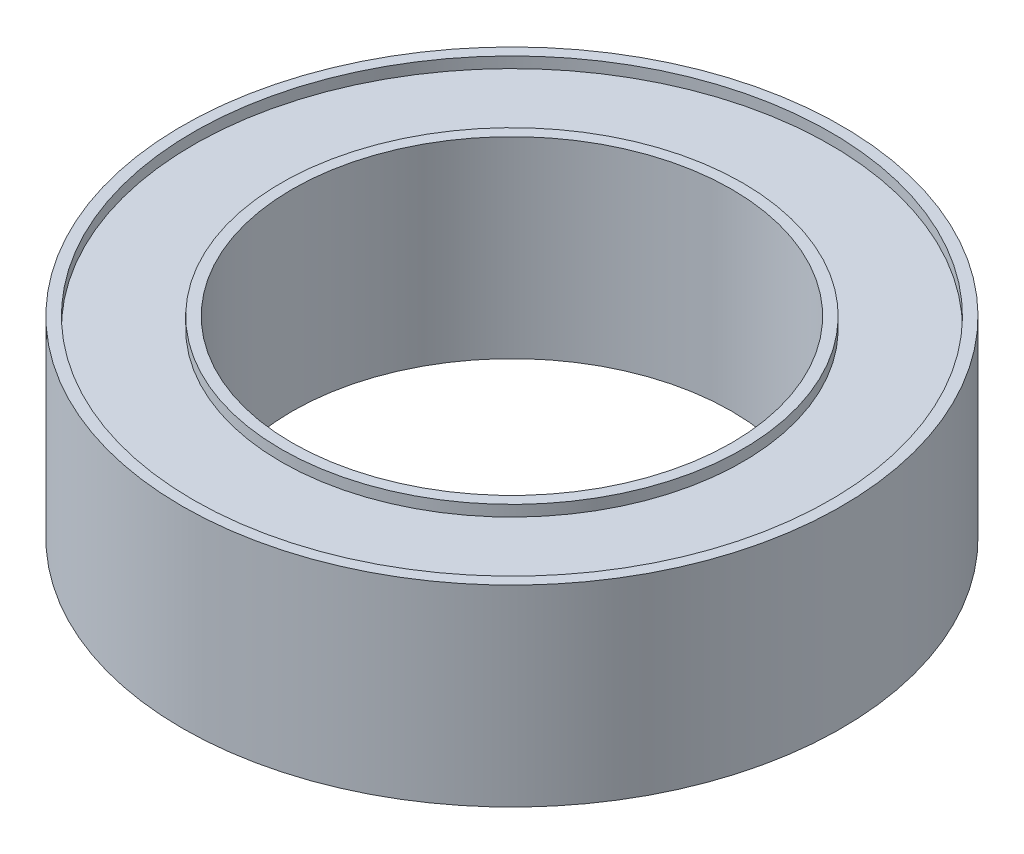
ISO-10303-21;
HEADER;
FILE_DESCRIPTION(('STEP AP214'),'2;1');
FILE_NAME('part.step','',(''),(''),'','','');
FILE_SCHEMA(('AUTOMOTIVE_DESIGN { 1 0 10303 214 1 1 1 1 }'));
ENDSEC;
DATA;
#1=APPLICATION_CONTEXT('core data for automotive mechanical design processes');
#2=APPLICATION_PROTOCOL_DEFINITION('international standard','automotive_design',2000,#1);
#3=PRODUCT_CONTEXT('',#1,'mechanical');
#4=PRODUCT('Part','Part','',(#3));
#5=PRODUCT_RELATED_PRODUCT_CATEGORY('part','',(#4));
#6=PRODUCT_DEFINITION_FORMATION('','',#4);
#7=PRODUCT_DEFINITION_CONTEXT('part definition',#1,'design');
#8=PRODUCT_DEFINITION('design','',#6,#7);
#9=PRODUCT_DEFINITION_SHAPE('','',#8);
#10=(LENGTH_UNIT() NAMED_UNIT(*) SI_UNIT(.MILLI.,.METRE.));
#11=(NAMED_UNIT(*) PLANE_ANGLE_UNIT() SI_UNIT($,.RADIAN.));
#12=(NAMED_UNIT(*) SI_UNIT($,.STERADIAN.) SOLID_ANGLE_UNIT());
#13=UNCERTAINTY_MEASURE_WITH_UNIT(LENGTH_MEASURE(1.E-05),#10,'distance_accuracy_value','');
#14=(GEOMETRIC_REPRESENTATION_CONTEXT(3) GLOBAL_UNCERTAINTY_ASSIGNED_CONTEXT((#13)) GLOBAL_UNIT_ASSIGNED_CONTEXT((#10,
#11,#12)) REPRESENTATION_CONTEXT('',''));
#15=CARTESIAN_POINT('',(0.,0.,0.));
#16=DIRECTION('',(0.,0.,1.));
#17=DIRECTION('',(1.,0.,0.));
#18=AXIS2_PLACEMENT_3D('',#15,#16,#17);
#19=CARTESIAN_POINT('',(0.,-1.75,0.));
#20=DIRECTION('',(0.,1.,0.));
#21=DIRECTION('',(0.,0.,1.));
#22=AXIS2_PLACEMENT_3D('',#19,#20,#21);
#23=PLANE('',#22);
#24=CARTESIAN_POINT('',(0.,-1.75,0.));
#25=DIRECTION('',(0.,1.,0.));
#26=DIRECTION('',(0.,0.,1.));
#27=AXIS2_PLACEMENT_3D('',#24,#25,#26);
#28=CIRCLE('',#27,4.);
#29=CARTESIAN_POINT('',(0.,-1.75,4.));
#30=VERTEX_POINT('',#29);
#31=EDGE_CURVE('E43',#30,#30,#28,.T.);
#32=ORIENTED_EDGE('',*,*,#31,.T.);
#33=EDGE_LOOP('',(#32));
#34=FACE_BOUND('',#33,.T.);
#35=CARTESIAN_POINT('',(0.,-1.75,0.));
#36=DIRECTION('',(0.,1.,0.));
#37=DIRECTION('',(0.,0.,1.));
#38=AXIS2_PLACEMENT_3D('',#35,#36,#37);
#39=CIRCLE('',#38,4.2);
#40=CARTESIAN_POINT('',(0.,-1.75,4.2));
#41=VERTEX_POINT('',#40);
#42=EDGE_CURVE('E67',#41,#41,#39,.T.);
#43=ORIENTED_EDGE('',*,*,#42,.F.);
#44=EDGE_LOOP('',(#43));
#45=FACE_BOUND('',#44,.T.);
#46=ADVANCED_FACE('F30',(#34,#45),#23,.F.);
#47=CARTESIAN_POINT('',(0.,1.75,0.));
#48=DIRECTION('',(0.,1.,0.));
#49=DIRECTION('',(0.,0.,1.));
#50=AXIS2_PLACEMENT_3D('',#47,#48,#49);
#51=PLANE('',#50);
#52=CARTESIAN_POINT('',(0.,1.75,0.));
#53=DIRECTION('',(0.,1.,0.));
#54=DIRECTION('',(0.,0.,1.));
#55=AXIS2_PLACEMENT_3D('',#52,#53,#54);
#56=CIRCLE('',#55,4.);
#57=CARTESIAN_POINT('',(0.,1.75,4.));
#58=VERTEX_POINT('',#57);
#59=EDGE_CURVE('E41',#58,#58,#56,.T.);
#60=ORIENTED_EDGE('',*,*,#59,.F.);
#61=EDGE_LOOP('',(#60));
#62=FACE_BOUND('',#61,.T.);
#63=CARTESIAN_POINT('',(0.,1.75,0.));
#64=DIRECTION('',(0.,1.,0.));
#65=DIRECTION('',(0.,0.,1.));
#66=AXIS2_PLACEMENT_3D('',#63,#64,#65);
#67=CIRCLE('',#66,4.2);
#68=CARTESIAN_POINT('',(0.,1.75,4.2));
#69=VERTEX_POINT('',#68);
#70=EDGE_CURVE('E55',#69,#69,#67,.T.);
#71=ORIENTED_EDGE('',*,*,#70,.T.);
#72=EDGE_LOOP('',(#71));
#73=FACE_BOUND('',#72,.T.);
#74=ADVANCED_FACE('F83',(#62,#73),#51,.T.);
#75=CARTESIAN_POINT('',(0.,1.75,0.));
#76=DIRECTION('',(0.,1.,0.));
#77=DIRECTION('',(0.,0.,1.));
#78=AXIS2_PLACEMENT_3D('',#75,#76,#77);
#79=CIRCLE('',#78,5.8);
#80=CARTESIAN_POINT('',(0.,1.75,5.8));
#81=VERTEX_POINT('',#80);
#82=EDGE_CURVE('E49',#81,#81,#79,.T.);
#83=ORIENTED_EDGE('',*,*,#82,.F.);
#84=EDGE_LOOP('',(#83));
#85=FACE_BOUND('',#84,.T.);
#86=CARTESIAN_POINT('',(0.,1.75,0.));
#87=DIRECTION('',(0.,1.,0.));
#88=DIRECTION('',(0.,0.,1.));
#89=AXIS2_PLACEMENT_3D('',#86,#87,#88);
#90=CIRCLE('',#89,6.);
#91=CARTESIAN_POINT('',(0.,1.75,6.));
#92=VERTEX_POINT('',#91);
#93=EDGE_CURVE('E10',#92,#92,#90,.T.);
#94=ORIENTED_EDGE('',*,*,#93,.T.);
#95=EDGE_LOOP('',(#94));
#96=FACE_BOUND('',#95,.T.);
#97=ADVANCED_FACE('F89',(#85,#96),#51,.T.);
#98=CARTESIAN_POINT('',(0.,-1.75,0.));
#99=DIRECTION('',(0.,1.,0.));
#100=DIRECTION('',(0.,0.,1.));
#101=AXIS2_PLACEMENT_3D('',#98,#99,#100);
#102=CIRCLE('',#101,5.8);
#103=CARTESIAN_POINT('',(0.,-1.75,5.8));
#104=VERTEX_POINT('',#103);
#105=EDGE_CURVE('E61',#104,#104,#102,.T.);
#106=ORIENTED_EDGE('',*,*,#105,.T.);
#107=EDGE_LOOP('',(#106));
#108=FACE_BOUND('',#107,.T.);
#109=CARTESIAN_POINT('',(0.,-1.75,0.));
#110=DIRECTION('',(0.,1.,0.));
#111=DIRECTION('',(0.,0.,1.));
#112=AXIS2_PLACEMENT_3D('',#109,#110,#111);
#113=CIRCLE('',#112,6.);
#114=CARTESIAN_POINT('',(0.,-1.75,6.));
#115=VERTEX_POINT('',#114);
#116=EDGE_CURVE('E34',#115,#115,#113,.T.);
#117=ORIENTED_EDGE('',*,*,#116,.F.);
#118=EDGE_LOOP('',(#117));
#119=FACE_BOUND('',#118,.T.);
#120=ADVANCED_FACE('F85',(#108,#119),#23,.F.);
#121=CARTESIAN_POINT('',(0.,1.75,0.));
#122=DIRECTION('',(0.,-1.,0.));
#123=DIRECTION('',(0.,0.,-1.));
#124=AXIS2_PLACEMENT_3D('',#121,#122,#123);
#125=CYLINDRICAL_SURFACE('',#124,6.);
#126=ORIENTED_EDGE('',*,*,#93,.F.);
#127=EDGE_LOOP('',(#126));
#128=FACE_BOUND('',#127,.T.);
#129=ORIENTED_EDGE('',*,*,#116,.T.);
#130=EDGE_LOOP('',(#129));
#131=FACE_BOUND('',#130,.T.);
#132=ADVANCED_FACE('F32',(#128,#131),#125,.T.);
#133=CARTESIAN_POINT('',(0.,1.75,0.));
#134=DIRECTION('',(0.,-1.,0.));
#135=DIRECTION('',(0.,0.,-1.));
#136=AXIS2_PLACEMENT_3D('',#133,#134,#135);
#137=CYLINDRICAL_SURFACE('',#136,4.);
#138=ORIENTED_EDGE('',*,*,#59,.T.);
#139=EDGE_LOOP('',(#138));
#140=FACE_BOUND('',#139,.T.);
#141=ORIENTED_EDGE('',*,*,#31,.F.);
#142=EDGE_LOOP('',(#141));
#143=FACE_BOUND('',#142,.T.);
#144=ADVANCED_FACE('F98',(#140,#143),#137,.F.);
#145=CARTESIAN_POINT('',(0.,1.55,0.));
#146=DIRECTION('',(0.,1.,0.));
#147=DIRECTION('',(0.,0.,1.));
#148=AXIS2_PLACEMENT_3D('',#145,#146,#147);
#149=CYLINDRICAL_SURFACE('',#148,5.8);
#150=CARTESIAN_POINT('',(0.,1.55,0.));
#151=DIRECTION('',(0.,1.,0.));
#152=DIRECTION('',(0.,0.,1.));
#153=AXIS2_PLACEMENT_3D('',#150,#151,#152);
#154=CIRCLE('',#153,5.8);
#155=CARTESIAN_POINT('',(0.,1.55,5.8));
#156=VERTEX_POINT('',#155);
#157=EDGE_CURVE('E46',#156,#156,#154,.T.);
#158=ORIENTED_EDGE('',*,*,#157,.F.);
#159=EDGE_LOOP('',(#158));
#160=FACE_BOUND('',#159,.T.);
#161=ORIENTED_EDGE('',*,*,#82,.T.);
#162=EDGE_LOOP('',(#161));
#163=FACE_BOUND('',#162,.T.);
#164=ADVANCED_FACE('F122',(#160,#163),#149,.F.);
#165=CARTESIAN_POINT('',(0.,1.55,0.));
#166=DIRECTION('',(0.,1.,0.));
#167=DIRECTION('',(0.,0.,1.));
#168=AXIS2_PLACEMENT_3D('',#165,#166,#167);
#169=PLANE('',#168);
#170=CARTESIAN_POINT('',(0.,1.55,0.));
#171=DIRECTION('',(0.,1.,0.));
#172=DIRECTION('',(0.,0.,1.));
#173=AXIS2_PLACEMENT_3D('',#170,#171,#172);
#174=CIRCLE('',#173,4.2);
#175=CARTESIAN_POINT('',(0.,1.55,4.2));
#176=VERTEX_POINT('',#175);
#177=EDGE_CURVE('E52',#176,#176,#174,.T.);
#178=ORIENTED_EDGE('',*,*,#177,.F.);
#179=EDGE_LOOP('',(#178));
#180=FACE_BOUND('',#179,.T.);
#181=ORIENTED_EDGE('',*,*,#157,.T.);
#182=EDGE_LOOP('',(#181));
#183=FACE_BOUND('',#182,.T.);
#184=ADVANCED_FACE('F118',(#180,#183),#169,.T.);
#185=CARTESIAN_POINT('',(0.,1.55,0.));
#186=DIRECTION('',(0.,1.,0.));
#187=DIRECTION('',(0.,0.,1.));
#188=AXIS2_PLACEMENT_3D('',#185,#186,#187);
#189=CYLINDRICAL_SURFACE('',#188,4.2);
#190=ORIENTED_EDGE('',*,*,#177,.T.);
#191=EDGE_LOOP('',(#190));
#192=FACE_BOUND('',#191,.T.);
#193=ORIENTED_EDGE('',*,*,#70,.F.);
#194=EDGE_LOOP('',(#193));
#195=FACE_BOUND('',#194,.T.);
#196=ADVANCED_FACE('F112',(#192,#195),#189,.T.);
#197=CARTESIAN_POINT('',(0.,-1.55,0.));
#198=DIRECTION('',(0.,-1.,0.));
#199=DIRECTION('',(0.,0.,1.));
#200=AXIS2_PLACEMENT_3D('',#197,#198,#199);
#201=PLANE('',#200);
#202=CARTESIAN_POINT('',(0.,-1.55,0.));
#203=DIRECTION('',(0.,1.,0.));
#204=DIRECTION('',(0.,0.,1.));
#205=AXIS2_PLACEMENT_3D('',#202,#203,#204);
#206=CIRCLE('',#205,5.8);
#207=CARTESIAN_POINT('',(0.,-1.55,5.8));
#208=VERTEX_POINT('',#207);
#209=EDGE_CURVE('E58',#208,#208,#206,.T.);
#210=ORIENTED_EDGE('',*,*,#209,.F.);
#211=EDGE_LOOP('',(#210));
#212=FACE_BOUND('',#211,.T.);
#213=CARTESIAN_POINT('',(0.,-1.55,0.));
#214=DIRECTION('',(0.,1.,0.));
#215=DIRECTION('',(0.,0.,1.));
#216=AXIS2_PLACEMENT_3D('',#213,#214,#215);
#217=CIRCLE('',#216,4.2);
#218=CARTESIAN_POINT('',(0.,-1.55,4.2));
#219=VERTEX_POINT('',#218);
#220=EDGE_CURVE('E64',#219,#219,#217,.T.);
#221=ORIENTED_EDGE('',*,*,#220,.T.);
#222=EDGE_LOOP('',(#221));
#223=FACE_BOUND('',#222,.T.);
#224=ADVANCED_FACE('F73',(#212,#223),#201,.T.);
#225=CARTESIAN_POINT('',(0.,-1.55,0.));
#226=DIRECTION('',(0.,-1.,0.));
#227=DIRECTION('',(0.,0.,-1.));
#228=AXIS2_PLACEMENT_3D('',#225,#226,#227);
#229=CYLINDRICAL_SURFACE('',#228,5.8);
#230=ORIENTED_EDGE('',*,*,#209,.T.);
#231=EDGE_LOOP('',(#230));
#232=FACE_BOUND('',#231,.T.);
#233=ORIENTED_EDGE('',*,*,#105,.F.);
#234=EDGE_LOOP('',(#233));
#235=FACE_BOUND('',#234,.T.);
#236=ADVANCED_FACE('F78',(#232,#235),#229,.F.);
#237=CARTESIAN_POINT('',(0.,-1.55,0.));
#238=DIRECTION('',(0.,-1.,0.));
#239=DIRECTION('',(0.,0.,-1.));
#240=AXIS2_PLACEMENT_3D('',#237,#238,#239);
#241=CYLINDRICAL_SURFACE('',#240,4.2);
#242=ORIENTED_EDGE('',*,*,#220,.F.);
#243=EDGE_LOOP('',(#242));
#244=FACE_BOUND('',#243,.T.);
#245=ORIENTED_EDGE('',*,*,#42,.T.);
#246=EDGE_LOOP('',(#245));
#247=FACE_BOUND('',#246,.T.);
#248=ADVANCED_FACE('F75',(#244,#247),#241,.T.);
#249=CLOSED_SHELL('',(#46,#74,#97,#120,#132,#144,#164,#184,#196,#224,#236,#248));
#250=MANIFOLD_SOLID_BREP('B2',#249);
#251=ADVANCED_BREP_SHAPE_REPRESENTATION('',(#18,#250),#14);
#252=SHAPE_DEFINITION_REPRESENTATION(#9,#251);
ENDSEC;
END-ISO-10303-21;
